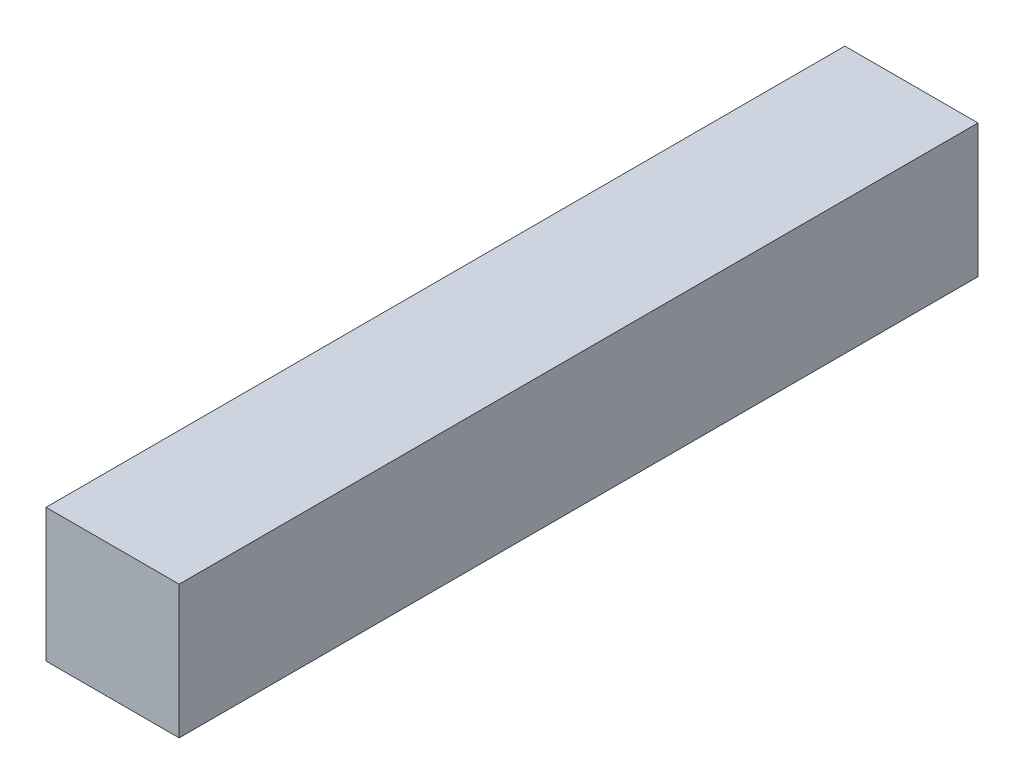
ISO-10303-21;
HEADER;
FILE_DESCRIPTION(('STEP AP214'),'2;1');
FILE_NAME('part.step','',(''),(''),'','','');
FILE_SCHEMA(('AUTOMOTIVE_DESIGN { 1 0 10303 214 1 1 1 1 }'));
ENDSEC;
DATA;
#1=APPLICATION_CONTEXT('core data for automotive mechanical design processes');
#2=APPLICATION_PROTOCOL_DEFINITION('international standard','automotive_design',2000,#1);
#3=PRODUCT_CONTEXT('',#1,'mechanical');
#4=PRODUCT('Part','Part','',(#3));
#5=PRODUCT_RELATED_PRODUCT_CATEGORY('part','',(#4));
#6=PRODUCT_DEFINITION_FORMATION('','',#4);
#7=PRODUCT_DEFINITION_CONTEXT('part definition',#1,'design');
#8=PRODUCT_DEFINITION('design','',#6,#7);
#9=PRODUCT_DEFINITION_SHAPE('','',#8);
#10=(LENGTH_UNIT() NAMED_UNIT(*) SI_UNIT(.MILLI.,.METRE.));
#11=(NAMED_UNIT(*) PLANE_ANGLE_UNIT() SI_UNIT($,.RADIAN.));
#12=(NAMED_UNIT(*) SI_UNIT($,.STERADIAN.) SOLID_ANGLE_UNIT());
#13=UNCERTAINTY_MEASURE_WITH_UNIT(LENGTH_MEASURE(1.E-05),#10,'distance_accuracy_value','');
#14=(GEOMETRIC_REPRESENTATION_CONTEXT(3) GLOBAL_UNCERTAINTY_ASSIGNED_CONTEXT((#13)) GLOBAL_UNIT_ASSIGNED_CONTEXT((#10,
#11,#12)) REPRESENTATION_CONTEXT('',''));
#15=CARTESIAN_POINT('',(0.,0.,0.));
#16=DIRECTION('',(0.,0.,1.));
#17=DIRECTION('',(1.,0.,0.));
#18=AXIS2_PLACEMENT_3D('',#15,#16,#17);
#19=CARTESIAN_POINT('',(0.,0.,76.2));
#20=DIRECTION('',(1.,0.,0.));
#21=DIRECTION('',(0.,1.,0.));
#22=AXIS2_PLACEMENT_3D('',#19,#20,#21);
#23=PLANE('',#22);
#24=DIRECTION('',(0.,-1.,0.));
#25=VECTOR('',#24,1.);
#26=CARTESIAN_POINT('',(0.,0.,0.));
#27=LINE('',#26,#25);
#28=CARTESIAN_POINT('',(0.,0.,0.));
#29=VERTEX_POINT('',#28);
#30=CARTESIAN_POINT('',(0.,-12.7,0.));
#31=VERTEX_POINT('',#30);
#32=EDGE_CURVE('E103',#29,#31,#27,.T.);
#33=ORIENTED_EDGE('',*,*,#32,.T.);
#34=DIRECTION('',(0.,0.,-1.));
#35=VECTOR('',#34,1.);
#36=CARTESIAN_POINT('',(0.,-12.7,76.2));
#37=LINE('',#36,#35);
#38=CARTESIAN_POINT('',(0.,-12.7,76.2));
#39=VERTEX_POINT('',#38);
#40=EDGE_CURVE('E12',#39,#31,#37,.T.);
#41=ORIENTED_EDGE('',*,*,#40,.F.);
#42=DIRECTION('',(0.,-1.,0.));
#43=VECTOR('',#42,1.);
#44=CARTESIAN_POINT('',(0.,0.,76.2));
#45=LINE('',#44,#43);
#46=CARTESIAN_POINT('',(0.,0.,76.2));
#47=VERTEX_POINT('',#46);
#48=EDGE_CURVE('E91',#47,#39,#45,.T.);
#49=ORIENTED_EDGE('',*,*,#48,.F.);
#50=DIRECTION('',(0.,0.,-1.));
#51=VECTOR('',#50,1.);
#52=CARTESIAN_POINT('',(0.,0.,76.2));
#53=LINE('',#52,#51);
#54=EDGE_CURVE('E99',#47,#29,#53,.T.);
#55=ORIENTED_EDGE('',*,*,#54,.T.);
#56=EDGE_LOOP('',(#33,#41,#49,#55));
#57=FACE_BOUND('',#56,.T.);
#58=ADVANCED_FACE('F39',(#57),#23,.F.);
#59=CARTESIAN_POINT('',(0.,-12.7,76.2));
#60=DIRECTION('',(0.,1.,0.));
#61=DIRECTION('',(0.,0.,1.));
#62=AXIS2_PLACEMENT_3D('',#59,#60,#61);
#63=PLANE('',#62);
#64=DIRECTION('',(1.,0.,0.));
#65=VECTOR('',#64,1.);
#66=CARTESIAN_POINT('',(0.,-12.7,0.));
#67=LINE('',#66,#65);
#68=CARTESIAN_POINT('',(12.7,-12.7,0.));
#69=VERTEX_POINT('',#68);
#70=EDGE_CURVE('E95',#31,#69,#67,.T.);
#71=ORIENTED_EDGE('',*,*,#70,.T.);
#72=DIRECTION('',(0.,0.,-1.));
#73=VECTOR('',#72,1.);
#74=CARTESIAN_POINT('',(12.7,-12.7,76.2));
#75=LINE('',#74,#73);
#76=CARTESIAN_POINT('',(12.7,-12.7,76.2));
#77=VERTEX_POINT('',#76);
#78=EDGE_CURVE('E48',#77,#69,#75,.T.);
#79=ORIENTED_EDGE('',*,*,#78,.F.);
#80=DIRECTION('',(1.,0.,0.));
#81=VECTOR('',#80,1.);
#82=CARTESIAN_POINT('',(0.,-12.7,76.2));
#83=LINE('',#82,#81);
#84=EDGE_CURVE('E86',#39,#77,#83,.T.);
#85=ORIENTED_EDGE('',*,*,#84,.F.);
#86=ORIENTED_EDGE('',*,*,#40,.T.);
#87=EDGE_LOOP('',(#71,#79,#85,#86));
#88=FACE_BOUND('',#87,.T.);
#89=ADVANCED_FACE('F94',(#88),#63,.F.);
#90=CARTESIAN_POINT('',(12.7,0.,76.2));
#91=DIRECTION('',(-1.,0.,0.));
#92=DIRECTION('',(0.,-1.,0.));
#93=AXIS2_PLACEMENT_3D('',#90,#91,#92);
#94=PLANE('',#93);
#95=DIRECTION('',(0.,1.,0.));
#96=VECTOR('',#95,1.);
#97=CARTESIAN_POINT('',(12.7,0.,0.));
#98=LINE('',#97,#96);
#99=CARTESIAN_POINT('',(12.7,0.,0.));
#100=VERTEX_POINT('',#99);
#101=EDGE_CURVE('E73',#69,#100,#98,.T.);
#102=ORIENTED_EDGE('',*,*,#101,.T.);
#103=DIRECTION('',(0.,0.,-1.));
#104=VECTOR('',#103,1.);
#105=CARTESIAN_POINT('',(12.7,0.,76.2));
#106=LINE('',#105,#104);
#107=CARTESIAN_POINT('',(12.7,0.,76.2));
#108=VERTEX_POINT('',#107);
#109=EDGE_CURVE('E96',#108,#100,#106,.T.);
#110=ORIENTED_EDGE('',*,*,#109,.F.);
#111=DIRECTION('',(0.,1.,0.));
#112=VECTOR('',#111,1.);
#113=CARTESIAN_POINT('',(12.7,0.,76.2));
#114=LINE('',#113,#112);
#115=EDGE_CURVE('E89',#77,#108,#114,.T.);
#116=ORIENTED_EDGE('',*,*,#115,.F.);
#117=ORIENTED_EDGE('',*,*,#78,.T.);
#118=EDGE_LOOP('',(#102,#110,#116,#117));
#119=FACE_BOUND('',#118,.T.);
#120=ADVANCED_FACE('F97',(#119),#94,.F.);
#121=CARTESIAN_POINT('',(0.,0.,76.2));
#122=DIRECTION('',(0.,-1.,0.));
#123=DIRECTION('',(0.,0.,-1.));
#124=AXIS2_PLACEMENT_3D('',#121,#122,#123);
#125=PLANE('',#124);
#126=DIRECTION('',(-1.,0.,0.));
#127=VECTOR('',#126,1.);
#128=CARTESIAN_POINT('',(0.,0.,0.));
#129=LINE('',#128,#127);
#130=EDGE_CURVE('E79',#100,#29,#129,.T.);
#131=ORIENTED_EDGE('',*,*,#130,.T.);
#132=ORIENTED_EDGE('',*,*,#54,.F.);
#133=DIRECTION('',(-1.,0.,0.));
#134=VECTOR('',#133,1.);
#135=CARTESIAN_POINT('',(0.,0.,76.2));
#136=LINE('',#135,#134);
#137=EDGE_CURVE('E56',#108,#47,#136,.T.);
#138=ORIENTED_EDGE('',*,*,#137,.F.);
#139=ORIENTED_EDGE('',*,*,#109,.T.);
#140=EDGE_LOOP('',(#131,#132,#138,#139));
#141=FACE_BOUND('',#140,.T.);
#142=ADVANCED_FACE('F113',(#141),#125,.F.);
#143=CARTESIAN_POINT('',(0.,0.,76.2));
#144=DIRECTION('',(0.,0.,1.));
#145=DIRECTION('',(1.,0.,0.));
#146=AXIS2_PLACEMENT_3D('',#143,#144,#145);
#147=PLANE('',#146);
#148=ORIENTED_EDGE('',*,*,#48,.T.);
#149=ORIENTED_EDGE('',*,*,#84,.T.);
#150=ORIENTED_EDGE('',*,*,#115,.T.);
#151=ORIENTED_EDGE('',*,*,#137,.T.);
#152=EDGE_LOOP('',(#148,#149,#150,#151));
#153=FACE_BOUND('',#152,.T.);
#154=ADVANCED_FACE('F87',(#153),#147,.T.);
#155=CARTESIAN_POINT('',(0.,0.,0.));
#156=DIRECTION('',(0.,0.,1.));
#157=DIRECTION('',(1.,0.,0.));
#158=AXIS2_PLACEMENT_3D('',#155,#156,#157);
#159=PLANE('',#158);
#160=ORIENTED_EDGE('',*,*,#32,.F.);
#161=ORIENTED_EDGE('',*,*,#130,.F.);
#162=ORIENTED_EDGE('',*,*,#101,.F.);
#163=ORIENTED_EDGE('',*,*,#70,.F.);
#164=EDGE_LOOP('',(#160,#161,#162,#163));
#165=FACE_BOUND('',#164,.T.);
#166=ADVANCED_FACE('F116',(#165),#159,.F.);
#167=CLOSED_SHELL('',(#58,#89,#120,#142,#154,#166));
#168=MANIFOLD_SOLID_BREP('B2',#167);
#169=ADVANCED_BREP_SHAPE_REPRESENTATION('',(#18,#168),#14);
#170=SHAPE_DEFINITION_REPRESENTATION(#9,#169);
ENDSEC;
END-ISO-10303-21;
